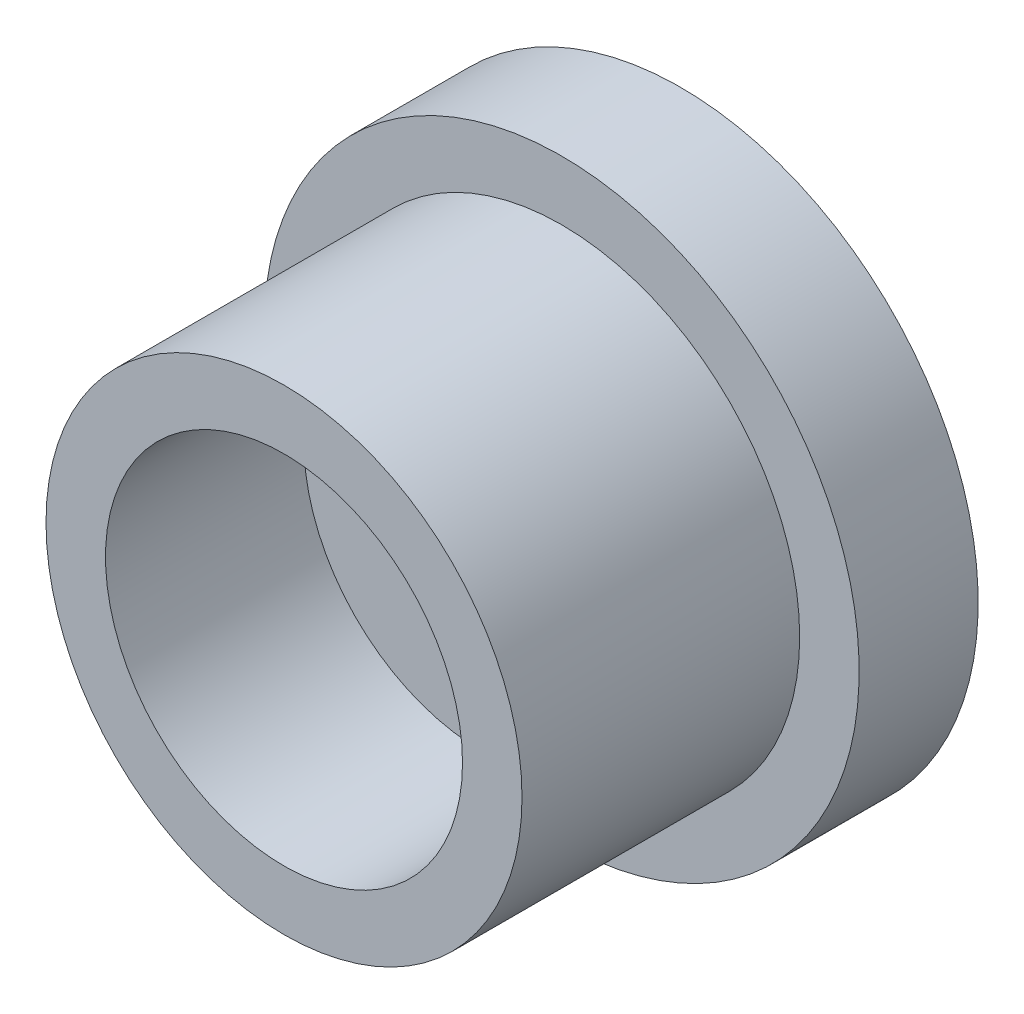
ISO-10303-21;
HEADER;
FILE_DESCRIPTION(('STEP AP214'),'2;1');
FILE_NAME('part.step','',(''),(''),'','','');
FILE_SCHEMA(('AUTOMOTIVE_DESIGN { 1 0 10303 214 1 1 1 1 }'));
ENDSEC;
DATA;
#1=APPLICATION_CONTEXT('core data for automotive mechanical design processes');
#2=APPLICATION_PROTOCOL_DEFINITION('international standard','automotive_design',2000,#1);
#3=PRODUCT_CONTEXT('',#1,'mechanical');
#4=PRODUCT('Part','Part','',(#3));
#5=PRODUCT_RELATED_PRODUCT_CATEGORY('part','',(#4));
#6=PRODUCT_DEFINITION_FORMATION('','',#4);
#7=PRODUCT_DEFINITION_CONTEXT('part definition',#1,'design');
#8=PRODUCT_DEFINITION('design','',#6,#7);
#9=PRODUCT_DEFINITION_SHAPE('','',#8);
#10=(LENGTH_UNIT() NAMED_UNIT(*) SI_UNIT(.MILLI.,.METRE.));
#11=(NAMED_UNIT(*) PLANE_ANGLE_UNIT() SI_UNIT($,.RADIAN.));
#12=(NAMED_UNIT(*) SI_UNIT($,.STERADIAN.) SOLID_ANGLE_UNIT());
#13=UNCERTAINTY_MEASURE_WITH_UNIT(LENGTH_MEASURE(1.E-05),#10,'distance_accuracy_value','');
#14=(GEOMETRIC_REPRESENTATION_CONTEXT(3) GLOBAL_UNCERTAINTY_ASSIGNED_CONTEXT((#13)) GLOBAL_UNIT_ASSIGNED_CONTEXT((#10,
#11,#12)) REPRESENTATION_CONTEXT('',''));
#15=CARTESIAN_POINT('',(0.,0.,0.));
#16=DIRECTION('',(0.,0.,1.));
#17=DIRECTION('',(1.,0.,0.));
#18=AXIS2_PLACEMENT_3D('',#15,#16,#17);
#19=CARTESIAN_POINT('',(0.,0.,7.));
#20=DIRECTION('',(0.,0.,-1.));
#21=DIRECTION('',(-1.,0.,0.));
#22=AXIS2_PLACEMENT_3D('',#19,#20,#21);
#23=CYLINDRICAL_SURFACE('',#22,6.);
#24=CARTESIAN_POINT('',(0.,0.,7.));
#25=DIRECTION('',(0.,0.,1.));
#26=DIRECTION('',(1.,0.,0.));
#27=AXIS2_PLACEMENT_3D('',#24,#25,#26);
#28=CIRCLE('',#27,6.);
#29=CARTESIAN_POINT('',(6.,0.,7.));
#30=VERTEX_POINT('',#29);
#31=EDGE_CURVE('E10',#30,#30,#28,.T.);
#32=ORIENTED_EDGE('',*,*,#31,.F.);
#33=EDGE_LOOP('',(#32));
#34=FACE_BOUND('',#33,.T.);
#35=CARTESIAN_POINT('',(0.,0.,0.));
#36=DIRECTION('',(0.,0.,1.));
#37=DIRECTION('',(1.,0.,0.));
#38=AXIS2_PLACEMENT_3D('',#35,#36,#37);
#39=CIRCLE('',#38,6.);
#40=CARTESIAN_POINT('',(6.,0.,0.));
#41=VERTEX_POINT('',#40);
#42=EDGE_CURVE('E46',#41,#41,#39,.T.);
#43=ORIENTED_EDGE('',*,*,#42,.T.);
#44=EDGE_LOOP('',(#43));
#45=FACE_BOUND('',#44,.T.);
#46=ADVANCED_FACE('F43',(#34,#45),#23,.T.);
#47=CARTESIAN_POINT('',(0.,0.,7.));
#48=DIRECTION('',(0.,0.,1.));
#49=DIRECTION('',(1.,0.,0.));
#50=AXIS2_PLACEMENT_3D('',#47,#48,#49);
#51=PLANE('',#50);
#52=CARTESIAN_POINT('',(0.,0.,7.));
#53=DIRECTION('',(0.,0.,1.));
#54=DIRECTION('',(1.,0.,0.));
#55=AXIS2_PLACEMENT_3D('',#52,#53,#54);
#56=CIRCLE('',#55,4.5);
#57=CARTESIAN_POINT('',(4.5,0.,7.));
#58=VERTEX_POINT('',#57);
#59=EDGE_CURVE('E56',#58,#58,#56,.T.);
#60=ORIENTED_EDGE('',*,*,#59,.F.);
#61=EDGE_LOOP('',(#60));
#62=FACE_BOUND('',#61,.T.);
#63=ORIENTED_EDGE('',*,*,#31,.T.);
#64=EDGE_LOOP('',(#63));
#65=FACE_BOUND('',#64,.T.);
#66=ADVANCED_FACE('F97',(#62,#65),#51,.T.);
#67=CARTESIAN_POINT('',(0.,0.,2.));
#68=DIRECTION('',(0.,0.,1.));
#69=DIRECTION('',(1.,0.,0.));
#70=AXIS2_PLACEMENT_3D('',#67,#68,#69);
#71=CYLINDRICAL_SURFACE('',#70,4.5);
#72=CARTESIAN_POINT('',(0.,0.,2.));
#73=DIRECTION('',(0.,0.,1.));
#74=DIRECTION('',(1.,0.,0.));
#75=AXIS2_PLACEMENT_3D('',#72,#73,#74);
#76=CIRCLE('',#75,4.5);
#77=CARTESIAN_POINT('',(4.5,0.,2.));
#78=VERTEX_POINT('',#77);
#79=EDGE_CURVE('E51',#78,#78,#76,.T.);
#80=ORIENTED_EDGE('',*,*,#79,.F.);
#81=EDGE_LOOP('',(#80));
#82=FACE_BOUND('',#81,.T.);
#83=ORIENTED_EDGE('',*,*,#59,.T.);
#84=EDGE_LOOP('',(#83));
#85=FACE_BOUND('',#84,.T.);
#86=ADVANCED_FACE('F93',(#82,#85),#71,.F.);
#87=CARTESIAN_POINT('',(0.,0.,2.));
#88=DIRECTION('',(0.,0.,1.));
#89=DIRECTION('',(1.,0.,0.));
#90=AXIS2_PLACEMENT_3D('',#87,#88,#89);
#91=PLANE('',#90);
#92=ORIENTED_EDGE('',*,*,#79,.T.);
#93=EDGE_LOOP('',(#92));
#94=FACE_BOUND('',#93,.T.);
#95=ADVANCED_FACE('F85',(#94),#91,.T.);
#96=CARTESIAN_POINT('',(0.,0.,-3.));
#97=DIRECTION('',(0.,0.,1.));
#98=DIRECTION('',(1.,0.,0.));
#99=AXIS2_PLACEMENT_3D('',#96,#97,#98);
#100=CYLINDRICAL_SURFACE('',#99,7.5);
#101=CARTESIAN_POINT('',(0.,0.,-3.));
#102=DIRECTION('',(0.,0.,-1.));
#103=DIRECTION('',(-1.,0.,0.));
#104=AXIS2_PLACEMENT_3D('',#101,#102,#103);
#105=CIRCLE('',#104,7.5);
#106=CARTESIAN_POINT('',(-7.5,0.,-3.));
#107=VERTEX_POINT('',#106);
#108=EDGE_CURVE('E66',#107,#107,#105,.T.);
#109=ORIENTED_EDGE('',*,*,#108,.F.);
#110=EDGE_LOOP('',(#109));
#111=FACE_BOUND('',#110,.T.);
#112=CARTESIAN_POINT('',(0.,0.,0.));
#113=DIRECTION('',(0.,0.,-1.));
#114=DIRECTION('',(-1.,0.,0.));
#115=AXIS2_PLACEMENT_3D('',#112,#113,#114);
#116=CIRCLE('',#115,7.5);
#117=CARTESIAN_POINT('',(-7.5,0.,0.));
#118=VERTEX_POINT('',#117);
#119=EDGE_CURVE('E62',#118,#118,#116,.T.);
#120=ORIENTED_EDGE('',*,*,#119,.T.);
#121=EDGE_LOOP('',(#120));
#122=FACE_BOUND('',#121,.T.);
#123=ADVANCED_FACE('F83',(#111,#122),#100,.T.);
#124=CARTESIAN_POINT('',(0.,0.,-3.));
#125=DIRECTION('',(0.,0.,-1.));
#126=DIRECTION('',(-1.,0.,0.));
#127=AXIS2_PLACEMENT_3D('',#124,#125,#126);
#128=PLANE('',#127);
#129=ORIENTED_EDGE('',*,*,#108,.T.);
#130=EDGE_LOOP('',(#129));
#131=FACE_BOUND('',#130,.T.);
#132=ADVANCED_FACE('F79',(#131),#128,.T.);
#133=CARTESIAN_POINT('',(0.,0.,0.));
#134=DIRECTION('',(0.,0.,-1.));
#135=DIRECTION('',(-1.,0.,0.));
#136=AXIS2_PLACEMENT_3D('',#133,#134,#135);
#137=PLANE('',#136);
#138=ORIENTED_EDGE('',*,*,#42,.F.);
#139=EDGE_LOOP('',(#138));
#140=FACE_BOUND('',#139,.T.);
#141=ORIENTED_EDGE('',*,*,#119,.F.);
#142=EDGE_LOOP('',(#141));
#143=FACE_BOUND('',#142,.T.);
#144=ADVANCED_FACE('F76',(#140,#143),#137,.F.);
#145=CLOSED_SHELL('',(#46,#66,#86,#95,#123,#132,#144));
#146=MANIFOLD_SOLID_BREP('B2',#145);
#147=ADVANCED_BREP_SHAPE_REPRESENTATION('',(#18,#146),#14);
#148=SHAPE_DEFINITION_REPRESENTATION(#9,#147);
ENDSEC;
END-ISO-10303-21;
